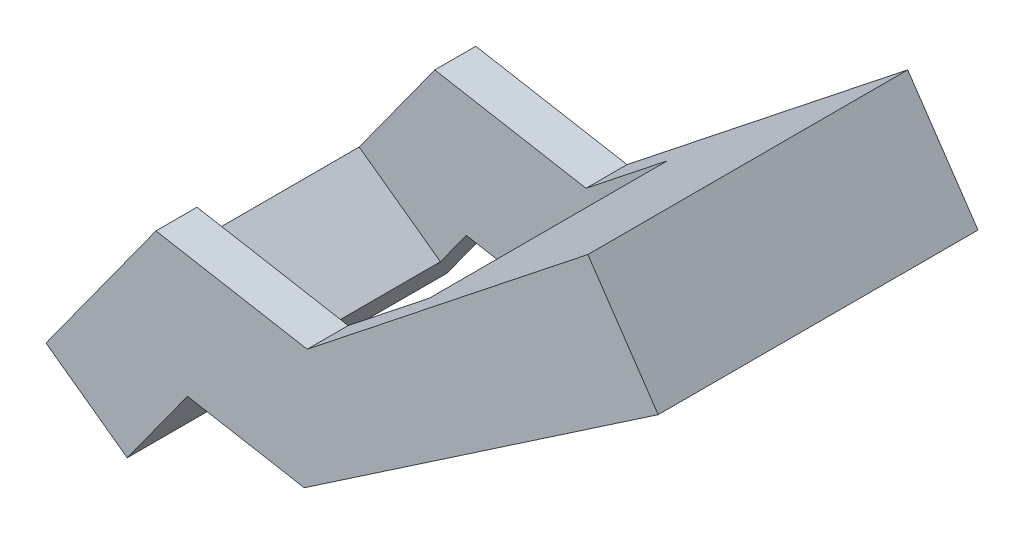
ISO-10303-21;
HEADER;
FILE_DESCRIPTION(('STEP AP214'),'2;1');
FILE_NAME('part.step','',(''),(''),'','','');
FILE_SCHEMA(('AUTOMOTIVE_DESIGN { 1 0 10303 214 1 1 1 1 }'));
ENDSEC;
DATA;
#1=APPLICATION_CONTEXT('core data for automotive mechanical design processes');
#2=APPLICATION_PROTOCOL_DEFINITION('international standard','automotive_design',2000,#1);
#3=PRODUCT_CONTEXT('',#1,'mechanical');
#4=PRODUCT('Part','Part','',(#3));
#5=PRODUCT_RELATED_PRODUCT_CATEGORY('part','',(#4));
#6=PRODUCT_DEFINITION_FORMATION('','',#4);
#7=PRODUCT_DEFINITION_CONTEXT('part definition',#1,'design');
#8=PRODUCT_DEFINITION('design','',#6,#7);
#9=PRODUCT_DEFINITION_SHAPE('','',#8);
#10=(LENGTH_UNIT() NAMED_UNIT(*) SI_UNIT(.MILLI.,.METRE.));
#11=(NAMED_UNIT(*) PLANE_ANGLE_UNIT() SI_UNIT($,.RADIAN.));
#12=(NAMED_UNIT(*) SI_UNIT($,.STERADIAN.) SOLID_ANGLE_UNIT());
#13=UNCERTAINTY_MEASURE_WITH_UNIT(LENGTH_MEASURE(1.E-05),#10,'distance_accuracy_value','');
#14=(GEOMETRIC_REPRESENTATION_CONTEXT(3) GLOBAL_UNCERTAINTY_ASSIGNED_CONTEXT((#13)) GLOBAL_UNIT_ASSIGNED_CONTEXT((#10,
#11,#12)) REPRESENTATION_CONTEXT('',''));
#15=CARTESIAN_POINT('',(0.,0.,0.));
#16=DIRECTION('',(0.,0.,1.));
#17=DIRECTION('',(1.,0.,0.));
#18=AXIS2_PLACEMENT_3D('',#15,#16,#17);
#19=CARTESIAN_POINT('',(0.,0.,-10.));
#20=DIRECTION('',(0.,0.,1.));
#21=DIRECTION('',(1.,0.,0.));
#22=AXIS2_PLACEMENT_3D('',#19,#20,#21);
#23=PLANE('',#22);
#24=DIRECTION('',(0.810387586601099,-0.585894153822041,0.));
#25=VECTOR('',#24,1.);
#26=CARTESIAN_POINT('',(4.42022128662641,-31.724173356034,-10.));
#27=LINE('',#26,#25);
#28=CARTESIAN_POINT('',(-15.3934462060486,-17.3992846957561,-10.));
#29=VERTEX_POINT('',#28);
#30=CARTESIAN_POINT('',(4.42022128662641,-31.724173356034,-10.));
#31=VERTEX_POINT('',#30);
#32=EDGE_CURVE('E193',#29,#31,#27,.T.);
#33=ORIENTED_EDGE('',*,*,#32,.F.);
#34=DIRECTION('',(-0.585894153822041,-0.8103875866011,0.));
#35=VECTOR('',#34,1.);
#36=CARTESIAN_POINT('',(-23.7804947775735,-28.9999467031273,-10.));
#37=LINE('',#36,#35);
#38=CARTESIAN_POINT('',(3.04376537505216,8.10239901177645,-10.));
#39=VERTEX_POINT('',#38);
#40=EDGE_CURVE('E161',#39,#29,#37,.T.);
#41=ORIENTED_EDGE('',*,*,#40,.F.);
#42=DIRECTION('',(-0.984555640322488,0.175071959802751,0.));
#43=VECTOR('',#42,1.);
#44=CARTESIAN_POINT('',(3.04376537505216,8.10239901177645,-10.));
#45=LINE('',#44,#43);
#46=CARTESIAN_POINT('',(39.923255905335,1.5445525892535,-10.));
#47=VERTEX_POINT('',#46);
#48=EDGE_CURVE('E224',#47,#39,#45,.T.);
#49=ORIENTED_EDGE('',*,*,#48,.F.);
#50=DIRECTION('',(-0.783798013737348,-0.621015840105055,0.));
#51=VECTOR('',#50,1.);
#52=CARTESIAN_POINT('',(39.923255905335,1.5445525892535,-10.));
#53=LINE('',#52,#51);
#54=CARTESIAN_POINT('',(59.7128123160552,17.2241381257232,-10.));
#55=VERTEX_POINT('',#54);
#56=EDGE_CURVE('E255',#55,#47,#53,.T.);
#57=ORIENTED_EDGE('',*,*,#56,.F.);
#58=DIRECTION('',(-0.561617962486082,0.827396678874759,0.));
#59=VECTOR('',#58,1.);
#60=CARTESIAN_POINT('',(59.7128123160552,17.2241381257232,-10.));
#61=LINE('',#60,#59);
#62=CARTESIAN_POINT('',(74.2922344286799,-4.254814190012,-10.));
#63=VERTEX_POINT('',#62);
#64=EDGE_CURVE('E52',#63,#55,#61,.T.);
#65=ORIENTED_EDGE('',*,*,#64,.F.);
#66=DIRECTION('',(0.827396678874759,0.561617962486083,0.));
#67=VECTOR('',#66,1.);
#68=CARTESIAN_POINT('',(125.526610047888,30.5219094531605,-10.));
#69=LINE('',#68,#67);
#70=CARTESIAN_POINT('',(39.2116070024128,-28.0667426167343,-10.));
#71=VERTEX_POINT('',#70);
#72=EDGE_CURVE('E204',#71,#63,#69,.T.);
#73=ORIENTED_EDGE('',*,*,#72,.F.);
#74=DIRECTION('',(0.984555640322487,-0.175071959802754,0.));
#75=VECTOR('',#74,1.);
#76=CARTESIAN_POINT('',(39.2116070024128,-28.0667426167343,-10.));
#77=LINE('',#76,#75);
#78=CARTESIAN_POINT('',(10.7264911134641,-23.0015691926571,-10.));
#79=VERTEX_POINT('',#78);
#80=EDGE_CURVE('E259',#79,#71,#77,.T.);
#81=ORIENTED_EDGE('',*,*,#80,.F.);
#82=DIRECTION('',(0.585894153822041,0.810387586601099,0.));
#83=VECTOR('',#82,1.);
#84=CARTESIAN_POINT('',(10.7264911134641,-23.0015691926571,-10.));
#85=LINE('',#84,#83);
#86=EDGE_CURVE('E97',#31,#79,#85,.T.);
#87=ORIENTED_EDGE('',*,*,#86,.F.);
#88=EDGE_LOOP('',(#33,#41,#49,#57,#65,#73,#81,#87));
#89=FACE_BOUND('',#88,.T.);
#90=ADVANCED_FACE('F35',(#89),#23,.F.);
#91=CARTESIAN_POINT('',(-23.7804947775735,-28.9999467031273,-10.));
#92=DIRECTION('',(-0.8103875866011,0.585894153822041,0.));
#93=DIRECTION('',(-0.585894153822041,-0.8103875866011,0.));
#94=AXIS2_PLACEMENT_3D('',#91,#92,#93);
#95=PLANE('',#94);
#96=DIRECTION('',(-0.585894153822041,-0.8103875866011,0.));
#97=VECTOR('',#96,1.);
#98=CARTESIAN_POINT('',(-23.7804947775735,-28.9999467031273,0.));
#99=LINE('',#98,#97);
#100=CARTESIAN_POINT('',(3.04376537505216,8.10239901177645,0.));
#101=VERTEX_POINT('',#100);
#102=CARTESIAN_POINT('',(-23.7804947775735,-28.9999467031273,0.));
#103=VERTEX_POINT('',#102);
#104=EDGE_CURVE('E212',#101,#103,#99,.T.);
#105=ORIENTED_EDGE('',*,*,#104,.F.);
#106=DIRECTION('',(0.,0.,1.));
#107=VECTOR('',#106,1.);
#108=CARTESIAN_POINT('',(3.04376537505216,8.10239901177645,-10.));
#109=LINE('',#108,#107);
#110=EDGE_CURVE('E11',#39,#101,#109,.T.);
#111=ORIENTED_EDGE('',*,*,#110,.F.);
#112=ORIENTED_EDGE('',*,*,#40,.T.);
#113=DIRECTION('',(0.,0.,1.));
#114=VECTOR('',#113,1.);
#115=CARTESIAN_POINT('',(-15.3934462060486,-17.3992846957561,-39.));
#116=LINE('',#115,#114);
#117=CARTESIAN_POINT('',(-15.3934462060486,-17.3992846957561,-68.));
#118=VERTEX_POINT('',#117);
#119=EDGE_CURVE('E156',#118,#29,#116,.T.);
#120=ORIENTED_EDGE('',*,*,#119,.F.);
#121=DIRECTION('',(-0.585894153822041,-0.8103875866011,0.));
#122=VECTOR('',#121,1.);
#123=CARTESIAN_POINT('',(-23.7804947775735,-28.9999467031273,-68.));
#124=LINE('',#123,#122);
#125=CARTESIAN_POINT('',(3.04376537505216,8.10239901177645,-68.));
#126=VERTEX_POINT('',#125);
#127=EDGE_CURVE('E159',#126,#118,#124,.T.);
#128=ORIENTED_EDGE('',*,*,#127,.F.);
#129=DIRECTION('',(0.,0.,-1.));
#130=VECTOR('',#129,1.);
#131=CARTESIAN_POINT('',(3.04376537505216,8.10239901177645,-68.));
#132=LINE('',#131,#130);
#133=CARTESIAN_POINT('',(3.04376537505216,8.10239901177645,-78.));
#134=VERTEX_POINT('',#133);
#135=EDGE_CURVE('E195',#126,#134,#132,.T.);
#136=ORIENTED_EDGE('',*,*,#135,.T.);
#137=DIRECTION('',(-0.585894153822041,-0.8103875866011,0.));
#138=VECTOR('',#137,1.);
#139=CARTESIAN_POINT('',(-23.7804947775735,-28.9999467031273,-78.));
#140=LINE('',#139,#138);
#141=CARTESIAN_POINT('',(-23.7804947775735,-28.9999467031273,-78.));
#142=VERTEX_POINT('',#141);
#143=EDGE_CURVE('E183',#134,#142,#140,.T.);
#144=ORIENTED_EDGE('',*,*,#143,.T.);
#145=DIRECTION('',(0.,0.,1.));
#146=VECTOR('',#145,1.);
#147=CARTESIAN_POINT('',(-23.7804947775735,-28.9999467031273,-10.));
#148=LINE('',#147,#146);
#149=EDGE_CURVE('E254',#142,#103,#148,.T.);
#150=ORIENTED_EDGE('',*,*,#149,.T.);
#151=EDGE_LOOP('',(#105,#111,#112,#120,#128,#136,#144,#150));
#152=FACE_BOUND('',#151,.T.);
#153=ADVANCED_FACE('F37',(#152),#95,.T.);
#154=CARTESIAN_POINT('',(3.04376537505216,8.10239901177645,-10.));
#155=DIRECTION('',(0.175071959802751,0.984555640322488,0.));
#156=DIRECTION('',(-0.984555640322488,0.175071959802751,0.));
#157=AXIS2_PLACEMENT_3D('',#154,#155,#156);
#158=PLANE('',#157);
#159=DIRECTION('',(-0.984555640322488,0.175071959802751,0.));
#160=VECTOR('',#159,1.);
#161=CARTESIAN_POINT('',(3.04376537505216,8.10239901177645,0.));
#162=LINE('',#161,#160);
#163=CARTESIAN_POINT('',(39.923255905335,1.5445525892535,0.));
#164=VERTEX_POINT('',#163);
#165=EDGE_CURVE('E241',#164,#101,#162,.T.);
#166=ORIENTED_EDGE('',*,*,#165,.F.);
#167=DIRECTION('',(0.,0.,1.));
#168=VECTOR('',#167,1.);
#169=CARTESIAN_POINT('',(39.923255905335,1.5445525892535,-10.));
#170=LINE('',#169,#168);
#171=EDGE_CURVE('E44',#47,#164,#170,.T.);
#172=ORIENTED_EDGE('',*,*,#171,.F.);
#173=ORIENTED_EDGE('',*,*,#48,.T.);
#174=ORIENTED_EDGE('',*,*,#110,.T.);
#175=EDGE_LOOP('',(#166,#172,#173,#174));
#176=FACE_BOUND('',#175,.T.);
#177=ADVANCED_FACE('F329',(#176),#158,.T.);
#178=CARTESIAN_POINT('',(39.923255905335,1.5445525892535,-10.));
#179=DIRECTION('',(-0.621015840105055,0.783798013737349,0.));
#180=DIRECTION('',(-0.783798013737349,-0.621015840105055,0.));
#181=AXIS2_PLACEMENT_3D('',#178,#179,#180);
#182=PLANE('',#181);
#183=DIRECTION('',(-0.783798013737348,-0.621015840105055,0.));
#184=VECTOR('',#183,1.);
#185=CARTESIAN_POINT('',(39.923255905335,1.5445525892535,0.));
#186=LINE('',#185,#184);
#187=CARTESIAN_POINT('',(108.379559315005,55.7835887023107,0.));
#188=VERTEX_POINT('',#187);
#189=EDGE_CURVE('E238',#188,#164,#186,.T.);
#190=ORIENTED_EDGE('',*,*,#189,.F.);
#191=DIRECTION('',(0.,0.,1.));
#192=VECTOR('',#191,1.);
#193=CARTESIAN_POINT('',(108.379559315005,55.7835887023107,-10.));
#194=LINE('',#193,#192);
#195=CARTESIAN_POINT('',(108.379559315005,55.7835887023107,-78.));
#196=VERTEX_POINT('',#195);
#197=EDGE_CURVE('E244',#196,#188,#194,.T.);
#198=ORIENTED_EDGE('',*,*,#197,.F.);
#199=DIRECTION('',(-0.783798013737348,-0.621015840105055,0.));
#200=VECTOR('',#199,1.);
#201=CARTESIAN_POINT('',(39.923255905335,1.5445525892535,-78.));
#202=LINE('',#201,#200);
#203=CARTESIAN_POINT('',(39.923255905335,1.5445525892535,-78.));
#204=VERTEX_POINT('',#203);
#205=EDGE_CURVE('E292',#196,#204,#202,.T.);
#206=ORIENTED_EDGE('',*,*,#205,.T.);
#207=DIRECTION('',(0.,0.,-1.));
#208=VECTOR('',#207,1.);
#209=CARTESIAN_POINT('',(39.923255905335,1.5445525892535,-68.));
#210=LINE('',#209,#208);
#211=CARTESIAN_POINT('',(39.923255905335,1.5445525892535,-68.));
#212=VERTEX_POINT('',#211);
#213=EDGE_CURVE('E287',#212,#204,#210,.T.);
#214=ORIENTED_EDGE('',*,*,#213,.F.);
#215=DIRECTION('',(-0.783798013737348,-0.621015840105055,0.));
#216=VECTOR('',#215,1.);
#217=CARTESIAN_POINT('',(39.923255905335,1.5445525892535,-68.));
#218=LINE('',#217,#216);
#219=CARTESIAN_POINT('',(59.7128123160552,17.2241381257232,-68.));
#220=VERTEX_POINT('',#219);
#221=EDGE_CURVE('E281',#220,#212,#218,.T.);
#222=ORIENTED_EDGE('',*,*,#221,.F.);
#223=DIRECTION('',(0.,0.,1.));
#224=VECTOR('',#223,1.);
#225=CARTESIAN_POINT('',(59.7128123160552,17.2241381257232,-39.));
#226=LINE('',#225,#224);
#227=EDGE_CURVE('E203',#220,#55,#226,.T.);
#228=ORIENTED_EDGE('',*,*,#227,.T.);
#229=ORIENTED_EDGE('',*,*,#56,.T.);
#230=ORIENTED_EDGE('',*,*,#171,.T.);
#231=EDGE_LOOP('',(#190,#198,#206,#214,#222,#228,#229,#230));
#232=FACE_BOUND('',#231,.T.);
#233=ADVANCED_FACE('F327',(#232),#182,.T.);
#234=CARTESIAN_POINT('',(108.379559315005,55.7835887023107,-10.));
#235=DIRECTION('',(0.827396678874759,0.561617962486083,0.));
#236=DIRECTION('',(-0.561617962486083,0.827396678874759,0.));
#237=AXIS2_PLACEMENT_3D('',#234,#235,#236);
#238=PLANE('',#237);
#239=DIRECTION('',(-0.561617962486083,0.827396678874759,0.));
#240=VECTOR('',#239,1.);
#241=CARTESIAN_POINT('',(108.379559315005,55.7835887023107,0.));
#242=LINE('',#241,#240);
#243=CARTESIAN_POINT('',(125.526610047888,30.5219094531605,0.));
#244=VERTEX_POINT('',#243);
#245=EDGE_CURVE('E235',#244,#188,#242,.T.);
#246=ORIENTED_EDGE('',*,*,#245,.F.);
#247=DIRECTION('',(0.,0.,1.));
#248=VECTOR('',#247,1.);
#249=CARTESIAN_POINT('',(125.526610047888,30.5219094531605,-10.));
#250=LINE('',#249,#248);
#251=CARTESIAN_POINT('',(125.526610047888,30.5219094531605,-78.));
#252=VERTEX_POINT('',#251);
#253=EDGE_CURVE('E246',#252,#244,#250,.T.);
#254=ORIENTED_EDGE('',*,*,#253,.F.);
#255=DIRECTION('',(-0.561617962486083,0.827396678874759,0.));
#256=VECTOR('',#255,1.);
#257=CARTESIAN_POINT('',(108.379559315005,55.7835887023107,-78.));
#258=LINE('',#257,#256);
#259=EDGE_CURVE('E294',#252,#196,#258,.T.);
#260=ORIENTED_EDGE('',*,*,#259,.T.);
#261=ORIENTED_EDGE('',*,*,#197,.T.);
#262=EDGE_LOOP('',(#246,#254,#260,#261));
#263=FACE_BOUND('',#262,.T.);
#264=ADVANCED_FACE('F324',(#263),#238,.T.);
#265=CARTESIAN_POINT('',(125.526610047888,30.5219094531605,-10.));
#266=DIRECTION('',(0.561617962486083,-0.827396678874759,0.));
#267=DIRECTION('',(0.827396678874759,0.561617962486083,0.));
#268=AXIS2_PLACEMENT_3D('',#265,#266,#267);
#269=PLANE('',#268);
#270=DIRECTION('',(0.827396678874759,0.561617962486083,0.));
#271=VECTOR('',#270,1.);
#272=CARTESIAN_POINT('',(125.526610047888,30.5219094531605,0.));
#273=LINE('',#272,#271);
#274=CARTESIAN_POINT('',(39.2116070024128,-28.0667426167343,0.));
#275=VERTEX_POINT('',#274);
#276=EDGE_CURVE('E232',#275,#244,#273,.T.);
#277=ORIENTED_EDGE('',*,*,#276,.F.);
#278=DIRECTION('',(0.,0.,1.));
#279=VECTOR('',#278,1.);
#280=CARTESIAN_POINT('',(39.2116070024128,-28.0667426167343,-10.));
#281=LINE('',#280,#279);
#282=EDGE_CURVE('E248',#71,#275,#281,.T.);
#283=ORIENTED_EDGE('',*,*,#282,.F.);
#284=ORIENTED_EDGE('',*,*,#72,.T.);
#285=DIRECTION('',(0.,0.,1.));
#286=VECTOR('',#285,1.);
#287=CARTESIAN_POINT('',(74.2922344286799,-4.25481419001202,-39.));
#288=LINE('',#287,#286);
#289=CARTESIAN_POINT('',(74.2922344286799,-4.254814190012,-68.));
#290=VERTEX_POINT('',#289);
#291=EDGE_CURVE('E209',#290,#63,#288,.T.);
#292=ORIENTED_EDGE('',*,*,#291,.F.);
#293=DIRECTION('',(0.827396678874759,0.561617962486083,0.));
#294=VECTOR('',#293,1.);
#295=CARTESIAN_POINT('',(125.526610047888,30.5219094531605,-68.));
#296=LINE('',#295,#294);
#297=CARTESIAN_POINT('',(39.2116070024128,-28.0667426167343,-68.));
#298=VERTEX_POINT('',#297);
#299=EDGE_CURVE('E190',#298,#290,#296,.T.);
#300=ORIENTED_EDGE('',*,*,#299,.F.);
#301=DIRECTION('',(0.,0.,-1.));
#302=VECTOR('',#301,1.);
#303=CARTESIAN_POINT('',(39.2116070024128,-28.0667426167343,-68.));
#304=LINE('',#303,#302);
#305=CARTESIAN_POINT('',(39.2116070024128,-28.0667426167343,-78.));
#306=VERTEX_POINT('',#305);
#307=EDGE_CURVE('E284',#298,#306,#304,.T.);
#308=ORIENTED_EDGE('',*,*,#307,.T.);
#309=DIRECTION('',(0.827396678874759,0.561617962486083,0.));
#310=VECTOR('',#309,1.);
#311=CARTESIAN_POINT('',(125.526610047888,30.5219094531605,-78.));
#312=LINE('',#311,#310);
#313=EDGE_CURVE('E297',#306,#252,#312,.T.);
#314=ORIENTED_EDGE('',*,*,#313,.T.);
#315=ORIENTED_EDGE('',*,*,#253,.T.);
#316=EDGE_LOOP('',(#277,#283,#284,#292,#300,#308,#314,#315));
#317=FACE_BOUND('',#316,.T.);
#318=ADVANCED_FACE('F265',(#317),#269,.T.);
#319=CARTESIAN_POINT('',(39.2116070024128,-28.0667426167343,-10.));
#320=DIRECTION('',(-0.175071959802754,-0.984555640322487,0.));
#321=DIRECTION('',(0.984555640322487,-0.175071959802754,0.));
#322=AXIS2_PLACEMENT_3D('',#319,#320,#321);
#323=PLANE('',#322);
#324=DIRECTION('',(0.984555640322487,-0.175071959802754,0.));
#325=VECTOR('',#324,1.);
#326=CARTESIAN_POINT('',(39.2116070024128,-28.0667426167343,0.));
#327=LINE('',#326,#325);
#328=CARTESIAN_POINT('',(10.7264911134641,-23.0015691926571,0.));
#329=VERTEX_POINT('',#328);
#330=EDGE_CURVE('E229',#329,#275,#327,.T.);
#331=ORIENTED_EDGE('',*,*,#330,.F.);
#332=DIRECTION('',(0.,0.,1.));
#333=VECTOR('',#332,1.);
#334=CARTESIAN_POINT('',(10.7264911134641,-23.0015691926571,-10.));
#335=LINE('',#334,#333);
#336=EDGE_CURVE('E250',#79,#329,#335,.T.);
#337=ORIENTED_EDGE('',*,*,#336,.F.);
#338=ORIENTED_EDGE('',*,*,#80,.T.);
#339=ORIENTED_EDGE('',*,*,#282,.T.);
#340=EDGE_LOOP('',(#331,#337,#338,#339));
#341=FACE_BOUND('',#340,.T.);
#342=ADVANCED_FACE('F320',(#341),#323,.T.);
#343=CARTESIAN_POINT('',(10.7264911134641,-23.0015691926571,-10.));
#344=DIRECTION('',(0.810387586601099,-0.585894153822041,0.));
#345=DIRECTION('',(0.585894153822041,0.8103875866011,0.));
#346=AXIS2_PLACEMENT_3D('',#343,#344,#345);
#347=PLANE('',#346);
#348=DIRECTION('',(0.585894153822041,0.810387586601099,0.));
#349=VECTOR('',#348,1.);
#350=CARTESIAN_POINT('',(10.7264911134641,-23.0015691926571,0.));
#351=LINE('',#350,#349);
#352=CARTESIAN_POINT('',(-3.96682728489852,-43.3248353634053,0.));
#353=VERTEX_POINT('',#352);
#354=EDGE_CURVE('E221',#353,#329,#351,.T.);
#355=ORIENTED_EDGE('',*,*,#354,.F.);
#356=DIRECTION('',(0.,0.,1.));
#357=VECTOR('',#356,1.);
#358=CARTESIAN_POINT('',(-3.96682728489852,-43.3248353634053,-10.));
#359=LINE('',#358,#357);
#360=CARTESIAN_POINT('',(-3.96682728489852,-43.3248353634053,-78.));
#361=VERTEX_POINT('',#360);
#362=EDGE_CURVE('E252',#361,#353,#359,.T.);
#363=ORIENTED_EDGE('',*,*,#362,.F.);
#364=DIRECTION('',(0.585894153822041,0.810387586601099,0.));
#365=VECTOR('',#364,1.);
#366=CARTESIAN_POINT('',(10.7264911134641,-23.0015691926571,-78.));
#367=LINE('',#366,#365);
#368=CARTESIAN_POINT('',(10.7264911134641,-23.0015691926571,-78.));
#369=VERTEX_POINT('',#368);
#370=EDGE_CURVE('E302',#361,#369,#367,.T.);
#371=ORIENTED_EDGE('',*,*,#370,.T.);
#372=DIRECTION('',(0.,0.,-1.));
#373=VECTOR('',#372,1.);
#374=CARTESIAN_POINT('',(10.7264911134641,-23.0015691926571,-68.));
#375=LINE('',#374,#373);
#376=CARTESIAN_POINT('',(10.7264911134641,-23.0015691926571,-68.));
#377=VERTEX_POINT('',#376);
#378=EDGE_CURVE('E271',#377,#369,#375,.T.);
#379=ORIENTED_EDGE('',*,*,#378,.F.);
#380=DIRECTION('',(0.585894153822041,0.810387586601099,0.));
#381=VECTOR('',#380,1.);
#382=CARTESIAN_POINT('',(10.7264911134641,-23.0015691926571,-68.));
#383=LINE('',#382,#381);
#384=CARTESIAN_POINT('',(4.42022128662641,-31.724173356034,-68.));
#385=VERTEX_POINT('',#384);
#386=EDGE_CURVE('E175',#385,#377,#383,.T.);
#387=ORIENTED_EDGE('',*,*,#386,.F.);
#388=DIRECTION('',(0.,0.,1.));
#389=VECTOR('',#388,1.);
#390=CARTESIAN_POINT('',(4.42022128662641,-31.724173356034,-39.));
#391=LINE('',#390,#389);
#392=EDGE_CURVE('E165',#385,#31,#391,.T.);
#393=ORIENTED_EDGE('',*,*,#392,.T.);
#394=ORIENTED_EDGE('',*,*,#86,.T.);
#395=ORIENTED_EDGE('',*,*,#336,.T.);
#396=EDGE_LOOP('',(#355,#363,#371,#379,#387,#393,#394,#395));
#397=FACE_BOUND('',#396,.T.);
#398=ADVANCED_FACE('F269',(#397),#347,.T.);
#399=CARTESIAN_POINT('',(-3.96682728489852,-43.3248353634053,-10.));
#400=DIRECTION('',(-0.585894153822041,-0.8103875866011,0.));
#401=DIRECTION('',(0.8103875866011,-0.585894153822041,0.));
#402=AXIS2_PLACEMENT_3D('',#399,#400,#401);
#403=PLANE('',#402);
#404=DIRECTION('',(0.8103875866011,-0.585894153822041,0.));
#405=VECTOR('',#404,1.);
#406=CARTESIAN_POINT('',(-3.96682728489852,-43.3248353634053,0.));
#407=LINE('',#406,#405);
#408=EDGE_CURVE('E216',#103,#353,#407,.T.);
#409=ORIENTED_EDGE('',*,*,#408,.F.);
#410=ORIENTED_EDGE('',*,*,#149,.F.);
#411=DIRECTION('',(0.8103875866011,-0.585894153822041,0.));
#412=VECTOR('',#411,1.);
#413=CARTESIAN_POINT('',(-3.96682728489852,-43.3248353634053,-78.));
#414=LINE('',#413,#412);
#415=EDGE_CURVE('E304',#142,#361,#414,.T.);
#416=ORIENTED_EDGE('',*,*,#415,.T.);
#417=ORIENTED_EDGE('',*,*,#362,.T.);
#418=EDGE_LOOP('',(#409,#410,#416,#417));
#419=FACE_BOUND('',#418,.T.);
#420=ADVANCED_FACE('F317',(#419),#403,.T.);
#421=CARTESIAN_POINT('',(0.,0.,0.));
#422=DIRECTION('',(0.,0.,1.));
#423=DIRECTION('',(1.,0.,0.));
#424=AXIS2_PLACEMENT_3D('',#421,#422,#423);
#425=PLANE('',#424);
#426=ORIENTED_EDGE('',*,*,#104,.T.);
#427=ORIENTED_EDGE('',*,*,#408,.T.);
#428=ORIENTED_EDGE('',*,*,#354,.T.);
#429=ORIENTED_EDGE('',*,*,#330,.T.);
#430=ORIENTED_EDGE('',*,*,#276,.T.);
#431=ORIENTED_EDGE('',*,*,#245,.T.);
#432=ORIENTED_EDGE('',*,*,#189,.T.);
#433=ORIENTED_EDGE('',*,*,#165,.T.);
#434=EDGE_LOOP('',(#426,#427,#428,#429,#430,#431,#432,#433));
#435=FACE_BOUND('',#434,.T.);
#436=ADVANCED_FACE('F318',(#435),#425,.T.);
#437=CARTESIAN_POINT('',(59.7128123160552,17.2241381257232,-39.));
#438=DIRECTION('',(0.827396678874759,0.561617962486082,0.));
#439=DIRECTION('',(-0.561617962486082,0.827396678874759,0.));
#440=AXIS2_PLACEMENT_3D('',#437,#438,#439);
#441=PLANE('',#440);
#442=ORIENTED_EDGE('',*,*,#64,.T.);
#443=ORIENTED_EDGE('',*,*,#227,.F.);
#444=DIRECTION('',(-0.561617962486082,0.827396678874759,0.));
#445=VECTOR('',#444,1.);
#446=CARTESIAN_POINT('',(59.7128123160552,17.2241381257232,-68.));
#447=LINE('',#446,#445);
#448=EDGE_CURVE('E180',#290,#220,#447,.T.);
#449=ORIENTED_EDGE('',*,*,#448,.F.);
#450=ORIENTED_EDGE('',*,*,#291,.T.);
#451=EDGE_LOOP('',(#442,#443,#449,#450));
#452=FACE_BOUND('',#451,.T.);
#453=ADVANCED_FACE('F330',(#452),#441,.F.);
#454=CARTESIAN_POINT('',(4.42022128662641,-31.724173356034,-39.));
#455=DIRECTION('',(-0.585894153822041,-0.810387586601099,0.));
#456=DIRECTION('',(0.810387586601099,-0.585894153822041,0.));
#457=AXIS2_PLACEMENT_3D('',#454,#455,#456);
#458=PLANE('',#457);
#459=ORIENTED_EDGE('',*,*,#32,.T.);
#460=ORIENTED_EDGE('',*,*,#392,.F.);
#461=DIRECTION('',(0.810387586601099,-0.585894153822041,0.));
#462=VECTOR('',#461,1.);
#463=CARTESIAN_POINT('',(4.42022128662641,-31.724173356034,-68.));
#464=LINE('',#463,#462);
#465=EDGE_CURVE('E171',#118,#385,#464,.T.);
#466=ORIENTED_EDGE('',*,*,#465,.F.);
#467=ORIENTED_EDGE('',*,*,#119,.T.);
#468=EDGE_LOOP('',(#459,#460,#466,#467));
#469=FACE_BOUND('',#468,.T.);
#470=ADVANCED_FACE('F178',(#469),#458,.F.);
#471=CARTESIAN_POINT('',(0.,0.,-68.));
#472=DIRECTION('',(0.,0.,-1.));
#473=DIRECTION('',(1.,0.,0.));
#474=AXIS2_PLACEMENT_3D('',#471,#472,#473);
#475=PLANE('',#474);
#476=ORIENTED_EDGE('',*,*,#465,.T.);
#477=ORIENTED_EDGE('',*,*,#386,.T.);
#478=DIRECTION('',(0.984555640322487,-0.175071959802754,0.));
#479=VECTOR('',#478,1.);
#480=CARTESIAN_POINT('',(39.2116070024128,-28.0667426167343,-68.));
#481=LINE('',#480,#479);
#482=EDGE_CURVE('E274',#377,#298,#481,.T.);
#483=ORIENTED_EDGE('',*,*,#482,.T.);
#484=ORIENTED_EDGE('',*,*,#299,.T.);
#485=ORIENTED_EDGE('',*,*,#448,.T.);
#486=ORIENTED_EDGE('',*,*,#221,.T.);
#487=DIRECTION('',(-0.984555640322488,0.175071959802751,0.));
#488=VECTOR('',#487,1.);
#489=CARTESIAN_POINT('',(3.04376537505216,8.10239901177645,-68.));
#490=LINE('',#489,#488);
#491=EDGE_CURVE('E174',#212,#126,#490,.T.);
#492=ORIENTED_EDGE('',*,*,#491,.T.);
#493=ORIENTED_EDGE('',*,*,#127,.T.);
#494=EDGE_LOOP('',(#476,#477,#483,#484,#485,#486,#492,#493));
#495=FACE_BOUND('',#494,.T.);
#496=ADVANCED_FACE('F169',(#495),#475,.F.);
#497=CARTESIAN_POINT('',(3.04376537505216,8.10239901177645,-68.));
#498=DIRECTION('',(0.175071959802751,0.984555640322488,0.));
#499=DIRECTION('',(-0.984555640322488,0.175071959802751,0.));
#500=AXIS2_PLACEMENT_3D('',#497,#498,#499);
#501=PLANE('',#500);
#502=DIRECTION('',(-0.984555640322488,0.175071959802751,0.));
#503=VECTOR('',#502,1.);
#504=CARTESIAN_POINT('',(3.04376537505216,8.10239901177645,-78.));
#505=LINE('',#504,#503);
#506=EDGE_CURVE('E176',#204,#134,#505,.T.);
#507=ORIENTED_EDGE('',*,*,#506,.T.);
#508=ORIENTED_EDGE('',*,*,#135,.F.);
#509=ORIENTED_EDGE('',*,*,#491,.F.);
#510=ORIENTED_EDGE('',*,*,#213,.T.);
#511=EDGE_LOOP('',(#507,#508,#509,#510));
#512=FACE_BOUND('',#511,.T.);
#513=ADVANCED_FACE('F336',(#512),#501,.T.);
#514=CARTESIAN_POINT('',(39.2116070024128,-28.0667426167343,-68.));
#515=DIRECTION('',(-0.175071959802754,-0.984555640322487,0.));
#516=DIRECTION('',(0.984555640322487,-0.175071959802754,0.));
#517=AXIS2_PLACEMENT_3D('',#514,#515,#516);
#518=PLANE('',#517);
#519=DIRECTION('',(0.984555640322487,-0.175071959802754,0.));
#520=VECTOR('',#519,1.);
#521=CARTESIAN_POINT('',(39.2116070024128,-28.0667426167343,-78.));
#522=LINE('',#521,#520);
#523=EDGE_CURVE('E300',#369,#306,#522,.T.);
#524=ORIENTED_EDGE('',*,*,#523,.T.);
#525=ORIENTED_EDGE('',*,*,#307,.F.);
#526=ORIENTED_EDGE('',*,*,#482,.F.);
#527=ORIENTED_EDGE('',*,*,#378,.T.);
#528=EDGE_LOOP('',(#524,#525,#526,#527));
#529=FACE_BOUND('',#528,.T.);
#530=ADVANCED_FACE('F338',(#529),#518,.T.);
#531=CARTESIAN_POINT('',(0.,0.,-78.));
#532=DIRECTION('',(0.,0.,-1.));
#533=DIRECTION('',(1.,0.,0.));
#534=AXIS2_PLACEMENT_3D('',#531,#532,#533);
#535=PLANE('',#534);
#536=ORIENTED_EDGE('',*,*,#143,.F.);
#537=ORIENTED_EDGE('',*,*,#506,.F.);
#538=ORIENTED_EDGE('',*,*,#205,.F.);
#539=ORIENTED_EDGE('',*,*,#259,.F.);
#540=ORIENTED_EDGE('',*,*,#313,.F.);
#541=ORIENTED_EDGE('',*,*,#523,.F.);
#542=ORIENTED_EDGE('',*,*,#370,.F.);
#543=ORIENTED_EDGE('',*,*,#415,.F.);
#544=EDGE_LOOP('',(#536,#537,#538,#539,#540,#541,#542,#543));
#545=FACE_BOUND('',#544,.T.);
#546=ADVANCED_FACE('F312',(#545),#535,.T.);
#547=CLOSED_SHELL('',(#90,#153,#177,#233,#264,#318,#342,#398,#420,#436,#453,#470,#496,#513,#530,#546));
#548=MANIFOLD_SOLID_BREP('B2',#547);
#549=ADVANCED_BREP_SHAPE_REPRESENTATION('',(#18,#548),#14);
#550=SHAPE_DEFINITION_REPRESENTATION(#9,#549);
ENDSEC;
END-ISO-10303-21;
